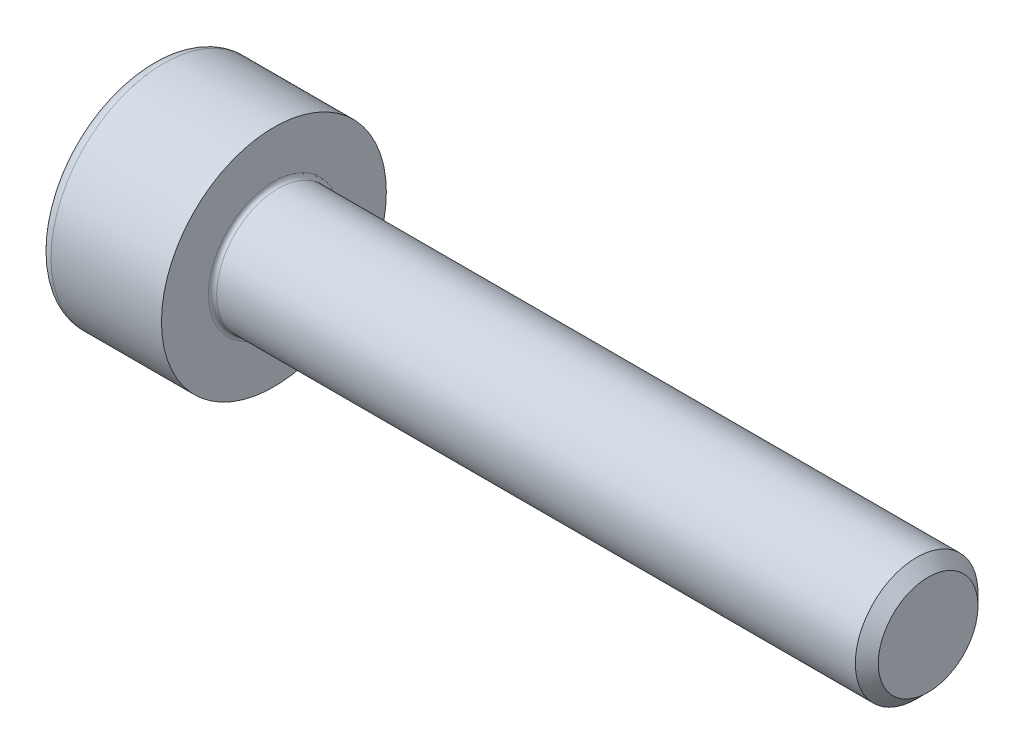
ISO-10303-21;
HEADER;
FILE_DESCRIPTION(('STEP AP214'),'2;1');
FILE_NAME('part.step','',(''),(''),'','','');
FILE_SCHEMA(('AUTOMOTIVE_DESIGN { 1 0 10303 214 1 1 1 1 }'));
ENDSEC;
DATA;
#1=APPLICATION_CONTEXT('core data for automotive mechanical design processes');
#2=APPLICATION_PROTOCOL_DEFINITION('international standard','automotive_design',2000,#1);
#3=PRODUCT_CONTEXT('',#1,'mechanical');
#4=PRODUCT('Part','Part','',(#3));
#5=PRODUCT_RELATED_PRODUCT_CATEGORY('part','',(#4));
#6=PRODUCT_DEFINITION_FORMATION('','',#4);
#7=PRODUCT_DEFINITION_CONTEXT('part definition',#1,'design');
#8=PRODUCT_DEFINITION('design','',#6,#7);
#9=PRODUCT_DEFINITION_SHAPE('','',#8);
#10=(LENGTH_UNIT() NAMED_UNIT(*) SI_UNIT(.MILLI.,.METRE.));
#11=(NAMED_UNIT(*) PLANE_ANGLE_UNIT() SI_UNIT($,.RADIAN.));
#12=(NAMED_UNIT(*) SI_UNIT($,.STERADIAN.) SOLID_ANGLE_UNIT());
#13=UNCERTAINTY_MEASURE_WITH_UNIT(LENGTH_MEASURE(1.E-05),#10,'distance_accuracy_value','');
#14=(GEOMETRIC_REPRESENTATION_CONTEXT(3) GLOBAL_UNCERTAINTY_ASSIGNED_CONTEXT((#13)) GLOBAL_UNIT_ASSIGNED_CONTEXT((#10,
#11,#12)) REPRESENTATION_CONTEXT('',''));
#15=CARTESIAN_POINT('',(0.,0.,0.));
#16=DIRECTION('',(0.,0.,1.));
#17=DIRECTION('',(1.,0.,0.));
#18=AXIS2_PLACEMENT_3D('',#15,#16,#17);
#19=CARTESIAN_POINT('',(0.,0.,0.));
#20=DIRECTION('',(-1.,0.,0.));
#21=DIRECTION('',(0.,0.,1.));
#22=AXIS2_PLACEMENT_3D('',#19,#20,#21);
#23=PLANE('',#22);
#24=DIRECTION('',(0.,-0.499999999999999,0.866025403784439));
#25=VECTOR('',#24,1.);
#26=CARTESIAN_POINT('',(0.,1.45492267835785,0.));
#27=LINE('',#26,#25);
#28=CARTESIAN_POINT('',(0.,1.45492267835785,0.));
#29=VERTEX_POINT('',#28);
#30=CARTESIAN_POINT('',(0.,0.727461339178922,1.26));
#31=VERTEX_POINT('',#30);
#32=EDGE_CURVE('E262',#29,#31,#27,.T.);
#33=ORIENTED_EDGE('',*,*,#32,.T.);
#34=DIRECTION('',(0.,1.,0.));
#35=VECTOR('',#34,1.);
#36=CARTESIAN_POINT('',(0.,-0.727461339178934,1.26));
#37=LINE('',#36,#35);
#38=CARTESIAN_POINT('',(0.,-0.727461339178934,1.26));
#39=VERTEX_POINT('',#38);
#40=EDGE_CURVE('E134',#39,#31,#37,.T.);
#41=ORIENTED_EDGE('',*,*,#40,.F.);
#42=DIRECTION('',(0.,-0.500000000000001,-0.866025403784438));
#43=VECTOR('',#42,1.);
#44=CARTESIAN_POINT('',(0.,-0.727461339178934,1.26));
#45=LINE('',#44,#43);
#46=CARTESIAN_POINT('',(0.,-1.45492267835786,0.));
#47=VERTEX_POINT('',#46);
#48=EDGE_CURVE('E265',#39,#47,#45,.T.);
#49=ORIENTED_EDGE('',*,*,#48,.T.);
#50=DIRECTION('',(0.,0.499999999999998,-0.86602540378444));
#51=VECTOR('',#50,1.);
#52=CARTESIAN_POINT('',(0.,-1.45492267835786,0.));
#53=LINE('',#52,#51);
#54=CARTESIAN_POINT('',(0.,-0.727461339178938,-1.26));
#55=VERTEX_POINT('',#54);
#56=EDGE_CURVE('E268',#47,#55,#53,.T.);
#57=ORIENTED_EDGE('',*,*,#56,.T.);
#58=DIRECTION('',(0.,-1.,0.));
#59=VECTOR('',#58,1.);
#60=CARTESIAN_POINT('',(0.,0.727461339178918,-1.26));
#61=LINE('',#60,#59);
#62=CARTESIAN_POINT('',(0.,0.727461339178918,-1.26));
#63=VERTEX_POINT('',#62);
#64=EDGE_CURVE('E271',#63,#55,#61,.T.);
#65=ORIENTED_EDGE('',*,*,#64,.F.);
#66=DIRECTION('',(0.,-0.500000000000001,-0.866025403784438));
#67=VECTOR('',#66,1.);
#68=CARTESIAN_POINT('',(0.,1.45492267835785,0.));
#69=LINE('',#68,#67);
#70=EDGE_CURVE('E129',#29,#63,#69,.T.);
#71=ORIENTED_EDGE('',*,*,#70,.F.);
#72=EDGE_LOOP('',(#33,#41,#49,#57,#65,#71));
#73=FACE_BOUND('',#72,.T.);
#74=CARTESIAN_POINT('',(0.,0.,0.));
#75=DIRECTION('',(-1.,0.,0.));
#76=DIRECTION('',(0.,0.,1.));
#77=AXIS2_PLACEMENT_3D('',#74,#75,#76);
#78=CIRCLE('',#77,2.45);
#79=CARTESIAN_POINT('',(0.,0.,2.45));
#80=VERTEX_POINT('',#79);
#81=EDGE_CURVE('E46',#80,#80,#78,.T.);
#82=ORIENTED_EDGE('',*,*,#81,.T.);
#83=EDGE_LOOP('',(#82));
#84=FACE_BOUND('',#83,.T.);
#85=ADVANCED_FACE('F38',(#73,#84),#23,.T.);
#86=CARTESIAN_POINT('',(-31.75,0.,0.));
#87=DIRECTION('',(-1.,0.,0.));
#88=DIRECTION('',(0.,0.,1.));
#89=AXIS2_PLACEMENT_3D('',#86,#87,#88);
#90=CYLINDRICAL_SURFACE('',#89,2.75);
#91=CARTESIAN_POINT('',(0.300000000000002,0.,0.));
#92=DIRECTION('',(-1.,0.,0.));
#93=DIRECTION('',(0.,0.,1.));
#94=AXIS2_PLACEMENT_3D('',#91,#92,#93);
#95=CIRCLE('',#94,2.75);
#96=CARTESIAN_POINT('',(0.300000000000002,0.,2.75));
#97=VERTEX_POINT('',#96);
#98=EDGE_CURVE('E11',#97,#97,#95,.F.);
#99=ORIENTED_EDGE('',*,*,#98,.T.);
#100=EDGE_LOOP('',(#99));
#101=FACE_BOUND('',#100,.T.);
#102=CARTESIAN_POINT('',(3.,0.,0.));
#103=DIRECTION('',(-1.,0.,0.));
#104=DIRECTION('',(0.,0.,1.));
#105=AXIS2_PLACEMENT_3D('',#102,#103,#104);
#106=CIRCLE('',#105,2.75);
#107=CARTESIAN_POINT('',(3.,0.,2.75));
#108=VERTEX_POINT('',#107);
#109=EDGE_CURVE('E152',#108,#108,#106,.T.);
#110=ORIENTED_EDGE('',*,*,#109,.T.);
#111=EDGE_LOOP('',(#110));
#112=FACE_BOUND('',#111,.T.);
#113=ADVANCED_FACE('F176',(#101,#112),#90,.T.);
#114=CARTESIAN_POINT('',(3.,2.75,0.));
#115=DIRECTION('',(1.,0.,0.));
#116=DIRECTION('',(0.,0.,-1.));
#117=AXIS2_PLACEMENT_3D('',#114,#115,#116);
#118=PLANE('',#117);
#119=CARTESIAN_POINT('',(3.,0.,0.));
#120=DIRECTION('',(1.,0.,0.));
#121=DIRECTION('',(0.,0.,-1.));
#122=AXIS2_PLACEMENT_3D('',#119,#120,#121);
#123=CIRCLE('',#122,1.59999999999996);
#124=CARTESIAN_POINT('',(3.,0.,-1.59999999999996));
#125=VERTEX_POINT('',#124);
#126=EDGE_CURVE('E155',#125,#125,#123,.F.);
#127=ORIENTED_EDGE('',*,*,#126,.T.);
#128=EDGE_LOOP('',(#127));
#129=FACE_BOUND('',#128,.T.);
#130=ORIENTED_EDGE('',*,*,#109,.F.);
#131=EDGE_LOOP('',(#130));
#132=FACE_BOUND('',#131,.T.);
#133=ADVANCED_FACE('F182',(#129,#132),#118,.T.);
#134=CARTESIAN_POINT('',(-31.75,0.,0.));
#135=DIRECTION('',(-1.,0.,0.));
#136=DIRECTION('',(0.,0.,1.));
#137=AXIS2_PLACEMENT_3D('',#134,#135,#136);
#138=CYLINDRICAL_SURFACE('',#137,1.49999999999996);
#139=CARTESIAN_POINT('',(3.1,0.,0.));
#140=DIRECTION('',(1.,0.,0.));
#141=DIRECTION('',(0.,0.,-1.));
#142=AXIS2_PLACEMENT_3D('',#139,#140,#141);
#143=CIRCLE('',#142,1.49999999999996);
#144=CARTESIAN_POINT('',(3.1,0.,-1.49999999999996));
#145=VERTEX_POINT('',#144);
#146=EDGE_CURVE('E158',#145,#145,#143,.T.);
#147=ORIENTED_EDGE('',*,*,#146,.T.);
#148=EDGE_LOOP('',(#147));
#149=FACE_BOUND('',#148,.T.);
#150=CARTESIAN_POINT('',(18.7194999999999,0.,0.));
#151=DIRECTION('',(-1.,0.,0.));
#152=DIRECTION('',(0.,0.,1.));
#153=AXIS2_PLACEMENT_3D('',#150,#151,#152);
#154=CIRCLE('',#153,1.49999999999991);
#155=CARTESIAN_POINT('',(18.7194999999999,0.,1.49999999999991));
#156=VERTEX_POINT('',#155);
#157=EDGE_CURVE('E149',#156,#156,#154,.T.);
#158=ORIENTED_EDGE('',*,*,#157,.T.);
#159=EDGE_LOOP('',(#158));
#160=FACE_BOUND('',#159,.T.);
#161=ADVANCED_FACE('F188',(#149,#160),#138,.T.);
#162=CARTESIAN_POINT('',(19.,0.,0.));
#163=DIRECTION('',(-1.,0.,0.));
#164=DIRECTION('',(0.,0.,1.));
#165=AXIS2_PLACEMENT_3D('',#162,#163,#164);
#166=CONICAL_SURFACE('',#165,1.2195,0.785398163397138);
#167=ORIENTED_EDGE('',*,*,#157,.F.);
#168=EDGE_LOOP('',(#167));
#169=FACE_BOUND('',#168,.T.);
#170=CARTESIAN_POINT('',(19.,0.,0.));
#171=DIRECTION('',(-1.,0.,0.));
#172=DIRECTION('',(0.,0.,1.));
#173=AXIS2_PLACEMENT_3D('',#170,#171,#172);
#174=CIRCLE('',#173,1.2195);
#175=CARTESIAN_POINT('',(19.,0.,1.2195));
#176=VERTEX_POINT('',#175);
#177=EDGE_CURVE('E145',#176,#176,#174,.T.);
#178=ORIENTED_EDGE('',*,*,#177,.T.);
#179=EDGE_LOOP('',(#178));
#180=FACE_BOUND('',#179,.T.);
#181=ADVANCED_FACE('F192',(#169,#180),#166,.T.);
#182=CARTESIAN_POINT('',(19.,1.2195,0.));
#183=DIRECTION('',(1.,0.,0.));
#184=DIRECTION('',(0.,0.,-1.));
#185=AXIS2_PLACEMENT_3D('',#182,#183,#184);
#186=PLANE('',#185);
#187=ORIENTED_EDGE('',*,*,#177,.F.);
#188=EDGE_LOOP('',(#187));
#189=FACE_BOUND('',#188,.T.);
#190=ADVANCED_FACE('F172',(#189),#186,.T.);
#191=CARTESIAN_POINT('',(3.1,0.,0.));
#192=DIRECTION('',(1.,0.,0.));
#193=DIRECTION('',(0.,0.,-1.));
#194=AXIS2_PLACEMENT_3D('',#191,#192,#193);
#195=TOROIDAL_SURFACE('',#194,1.59999999999996,0.1);
#196=ORIENTED_EDGE('',*,*,#146,.F.);
#197=EDGE_LOOP('',(#196));
#198=FACE_BOUND('',#197,.T.);
#199=ORIENTED_EDGE('',*,*,#126,.F.);
#200=EDGE_LOOP('',(#199));
#201=FACE_BOUND('',#200,.T.);
#202=ADVANCED_FACE('F165',(#198,#201),#195,.F.);
#203=CARTESIAN_POINT('',(0.300000000000002,0.,0.));
#204=DIRECTION('',(-1.,0.,0.));
#205=DIRECTION('',(0.,0.,1.));
#206=AXIS2_PLACEMENT_3D('',#203,#204,#205);
#207=TOROIDAL_SURFACE('',#206,2.45,0.3);
#208=ORIENTED_EDGE('',*,*,#98,.F.);
#209=EDGE_LOOP('',(#208));
#210=FACE_BOUND('',#209,.T.);
#211=ORIENTED_EDGE('',*,*,#81,.F.);
#212=EDGE_LOOP('',(#211));
#213=FACE_BOUND('',#212,.T.);
#214=ADVANCED_FACE('F40',(#210,#213),#207,.T.);
#215=CARTESIAN_POINT('',(1.3,1.45492267835785,0.));
#216=DIRECTION('',(0.,-0.866025403784439,-0.499999999999999));
#217=DIRECTION('',(0.,0.499999999999999,-0.866025403784439));
#218=AXIS2_PLACEMENT_3D('',#215,#216,#217);
#219=PLANE('',#218);
#220=ORIENTED_EDGE('',*,*,#32,.F.);
#221=DIRECTION('',(-1.,0.,0.));
#222=VECTOR('',#221,1.);
#223=CARTESIAN_POINT('',(1.3,1.45492267835785,0.));
#224=LINE('',#223,#222);
#225=CARTESIAN_POINT('',(1.3,1.45492267835785,0.));
#226=VERTEX_POINT('',#225);
#227=EDGE_CURVE('E252',#226,#29,#224,.T.);
#228=ORIENTED_EDGE('',*,*,#227,.F.);
#229=DIRECTION('',(0.,-0.499999999999999,0.866025403784439));
#230=VECTOR('',#229,1.);
#231=CARTESIAN_POINT('',(1.3,1.45492267835785,0.));
#232=LINE('',#231,#230);
#233=CARTESIAN_POINT('',(1.3,1.09119200876839,0.629999999999996));
#234=VERTEX_POINT('',#233);
#235=EDGE_CURVE('E121',#226,#234,#232,.T.);
#236=ORIENTED_EDGE('',*,*,#235,.T.);
#237=CARTESIAN_POINT('',(1.3,0.727461339178922,1.26));
#238=VERTEX_POINT('',#237);
#239=EDGE_CURVE('E112',#234,#238,#232,.T.);
#240=ORIENTED_EDGE('',*,*,#239,.T.);
#241=DIRECTION('',(-1.,0.,0.));
#242=VECTOR('',#241,1.);
#243=CARTESIAN_POINT('',(1.3,0.727461339178922,1.26));
#244=LINE('',#243,#242);
#245=EDGE_CURVE('E126',#238,#31,#244,.T.);
#246=ORIENTED_EDGE('',*,*,#245,.T.);
#247=EDGE_LOOP('',(#220,#228,#236,#240,#246));
#248=FACE_BOUND('',#247,.T.);
#249=ADVANCED_FACE('F125',(#248),#219,.T.);
#250=CARTESIAN_POINT('',(1.3,-0.727461339178934,1.26));
#251=DIRECTION('',(0.,0.,1.));
#252=DIRECTION('',(0.,-1.,0.));
#253=AXIS2_PLACEMENT_3D('',#250,#251,#252);
#254=PLANE('',#253);
#255=ORIENTED_EDGE('',*,*,#40,.T.);
#256=ORIENTED_EDGE('',*,*,#245,.F.);
#257=DIRECTION('',(0.,1.,0.));
#258=VECTOR('',#257,1.);
#259=CARTESIAN_POINT('',(1.3,-0.727461339178934,1.26));
#260=LINE('',#259,#258);
#261=CARTESIAN_POINT('',(1.3,0.,1.26));
#262=VERTEX_POINT('',#261);
#263=EDGE_CURVE('E109',#262,#238,#260,.T.);
#264=ORIENTED_EDGE('',*,*,#263,.F.);
#265=CARTESIAN_POINT('',(1.3,-0.727461339178934,1.26));
#266=VERTEX_POINT('',#265);
#267=EDGE_CURVE('E120',#266,#262,#260,.T.);
#268=ORIENTED_EDGE('',*,*,#267,.F.);
#269=DIRECTION('',(-1.,0.,0.));
#270=VECTOR('',#269,1.);
#271=CARTESIAN_POINT('',(1.3,-0.727461339178934,1.26));
#272=LINE('',#271,#270);
#273=EDGE_CURVE('E136',#266,#39,#272,.T.);
#274=ORIENTED_EDGE('',*,*,#273,.T.);
#275=EDGE_LOOP('',(#255,#256,#264,#268,#274));
#276=FACE_BOUND('',#275,.T.);
#277=ADVANCED_FACE('F131',(#276),#254,.F.);
#278=CARTESIAN_POINT('',(1.3,-0.727461339178934,1.26));
#279=DIRECTION('',(0.,0.866025403784438,-0.500000000000001));
#280=DIRECTION('',(0.,0.500000000000001,0.866025403784438));
#281=AXIS2_PLACEMENT_3D('',#278,#279,#280);
#282=PLANE('',#281);
#283=ORIENTED_EDGE('',*,*,#48,.F.);
#284=ORIENTED_EDGE('',*,*,#273,.F.);
#285=DIRECTION('',(0.,-0.500000000000001,-0.866025403784438));
#286=VECTOR('',#285,1.);
#287=CARTESIAN_POINT('',(1.3,-0.727461339178934,1.26));
#288=LINE('',#287,#286);
#289=CARTESIAN_POINT('',(1.3,-1.0911920087684,0.630000000000005));
#290=VERTEX_POINT('',#289);
#291=EDGE_CURVE('E291',#266,#290,#288,.T.);
#292=ORIENTED_EDGE('',*,*,#291,.T.);
#293=CARTESIAN_POINT('',(1.3,-1.45492267835786,0.));
#294=VERTEX_POINT('',#293);
#295=EDGE_CURVE('E280',#290,#294,#288,.T.);
#296=ORIENTED_EDGE('',*,*,#295,.T.);
#297=DIRECTION('',(-1.,0.,0.));
#298=VECTOR('',#297,1.);
#299=CARTESIAN_POINT('',(1.3,-1.45492267835786,0.));
#300=LINE('',#299,#298);
#301=EDGE_CURVE('E141',#294,#47,#300,.T.);
#302=ORIENTED_EDGE('',*,*,#301,.T.);
#303=EDGE_LOOP('',(#283,#284,#292,#296,#302));
#304=FACE_BOUND('',#303,.T.);
#305=ADVANCED_FACE('F206',(#304),#282,.T.);
#306=CARTESIAN_POINT('',(1.3,-1.45492267835786,0.));
#307=DIRECTION('',(0.,0.86602540378444,0.499999999999998));
#308=DIRECTION('',(0.,-0.499999999999998,0.86602540378444));
#309=AXIS2_PLACEMENT_3D('',#306,#307,#308);
#310=PLANE('',#309);
#311=ORIENTED_EDGE('',*,*,#56,.F.);
#312=ORIENTED_EDGE('',*,*,#301,.F.);
#313=DIRECTION('',(0.,0.499999999999998,-0.86602540378444));
#314=VECTOR('',#313,1.);
#315=CARTESIAN_POINT('',(1.3,-1.45492267835786,0.));
#316=LINE('',#315,#314);
#317=CARTESIAN_POINT('',(1.3,-1.0911920087684,-0.63));
#318=VERTEX_POINT('',#317);
#319=EDGE_CURVE('E258',#294,#318,#316,.T.);
#320=ORIENTED_EDGE('',*,*,#319,.T.);
#321=CARTESIAN_POINT('',(1.3,-0.727461339178938,-1.26));
#322=VERTEX_POINT('',#321);
#323=EDGE_CURVE('E290',#318,#322,#316,.T.);
#324=ORIENTED_EDGE('',*,*,#323,.T.);
#325=DIRECTION('',(-1.,0.,0.));
#326=VECTOR('',#325,1.);
#327=CARTESIAN_POINT('',(1.3,-0.727461339178938,-1.26));
#328=LINE('',#327,#326);
#329=EDGE_CURVE('E251',#322,#55,#328,.T.);
#330=ORIENTED_EDGE('',*,*,#329,.T.);
#331=EDGE_LOOP('',(#311,#312,#320,#324,#330));
#332=FACE_BOUND('',#331,.T.);
#333=ADVANCED_FACE('F209',(#332),#310,.T.);
#334=CARTESIAN_POINT('',(1.3,0.727461339178918,-1.26));
#335=DIRECTION('',(0.,0.,-1.));
#336=DIRECTION('',(0.,1.,0.));
#337=AXIS2_PLACEMENT_3D('',#334,#335,#336);
#338=PLANE('',#337);
#339=ORIENTED_EDGE('',*,*,#64,.T.);
#340=ORIENTED_EDGE('',*,*,#329,.F.);
#341=DIRECTION('',(0.,-1.,0.));
#342=VECTOR('',#341,1.);
#343=CARTESIAN_POINT('',(1.3,0.727461339178918,-1.26));
#344=LINE('',#343,#342);
#345=CARTESIAN_POINT('',(1.3,0.,-1.26));
#346=VERTEX_POINT('',#345);
#347=EDGE_CURVE('E255',#346,#322,#344,.T.);
#348=ORIENTED_EDGE('',*,*,#347,.F.);
#349=CARTESIAN_POINT('',(1.3,0.727461339178918,-1.26));
#350=VERTEX_POINT('',#349);
#351=EDGE_CURVE('E53',#350,#346,#344,.T.);
#352=ORIENTED_EDGE('',*,*,#351,.F.);
#353=DIRECTION('',(-1.,0.,0.));
#354=VECTOR('',#353,1.);
#355=CARTESIAN_POINT('',(1.3,0.727461339178918,-1.26));
#356=LINE('',#355,#354);
#357=EDGE_CURVE('E248',#350,#63,#356,.T.);
#358=ORIENTED_EDGE('',*,*,#357,.T.);
#359=EDGE_LOOP('',(#339,#340,#348,#352,#358));
#360=FACE_BOUND('',#359,.T.);
#361=ADVANCED_FACE('F213',(#360),#338,.F.);
#362=CARTESIAN_POINT('',(1.3,1.45492267835785,0.));
#363=DIRECTION('',(0.,0.866025403784438,-0.500000000000001));
#364=DIRECTION('',(0.,0.500000000000001,0.866025403784438));
#365=AXIS2_PLACEMENT_3D('',#362,#363,#364);
#366=PLANE('',#365);
#367=ORIENTED_EDGE('',*,*,#70,.T.);
#368=ORIENTED_EDGE('',*,*,#357,.F.);
#369=DIRECTION('',(0.,-0.500000000000001,-0.866025403784438));
#370=VECTOR('',#369,1.);
#371=CARTESIAN_POINT('',(1.3,1.45492267835785,0.));
#372=LINE('',#371,#370);
#373=CARTESIAN_POINT('',(1.3,1.09119200876838,-0.629999999999997));
#374=VERTEX_POINT('',#373);
#375=EDGE_CURVE('E238',#374,#350,#372,.T.);
#376=ORIENTED_EDGE('',*,*,#375,.F.);
#377=EDGE_CURVE('E244',#226,#374,#372,.T.);
#378=ORIENTED_EDGE('',*,*,#377,.F.);
#379=ORIENTED_EDGE('',*,*,#227,.T.);
#380=EDGE_LOOP('',(#367,#368,#376,#378,#379));
#381=FACE_BOUND('',#380,.T.);
#382=ADVANCED_FACE('F217',(#381),#366,.F.);
#383=CARTESIAN_POINT('',(1.3,2.18238401753677,-1.26));
#384=DIRECTION('',(1.,0.,0.));
#385=DIRECTION('',(0.,0.,-1.));
#386=AXIS2_PLACEMENT_3D('',#383,#384,#385);
#387=PLANE('',#386);
#388=ORIENTED_EDGE('',*,*,#347,.T.);
#389=ORIENTED_EDGE('',*,*,#323,.F.);
#390=CARTESIAN_POINT('',(1.3,0.,0.));
#391=DIRECTION('',(-1.,0.,0.));
#392=DIRECTION('',(0.,0.,1.));
#393=AXIS2_PLACEMENT_3D('',#390,#391,#392);
#394=CIRCLE('',#393,1.26);
#395=EDGE_CURVE('E286',#346,#318,#394,.T.);
#396=ORIENTED_EDGE('',*,*,#395,.F.);
#397=EDGE_LOOP('',(#388,#389,#396));
#398=FACE_BOUND('',#397,.T.);
#399=ADVANCED_FACE('F221',(#398),#387,.F.);
#400=ORIENTED_EDGE('',*,*,#319,.F.);
#401=ORIENTED_EDGE('',*,*,#295,.F.);
#402=EDGE_CURVE('E139',#318,#290,#394,.T.);
#403=ORIENTED_EDGE('',*,*,#402,.F.);
#404=EDGE_LOOP('',(#400,#401,#403));
#405=FACE_BOUND('',#404,.T.);
#406=ADVANCED_FACE('F224',(#405),#387,.F.);
#407=ORIENTED_EDGE('',*,*,#291,.F.);
#408=ORIENTED_EDGE('',*,*,#267,.T.);
#409=EDGE_CURVE('E135',#290,#262,#394,.T.);
#410=ORIENTED_EDGE('',*,*,#409,.F.);
#411=EDGE_LOOP('',(#407,#408,#410));
#412=FACE_BOUND('',#411,.T.);
#413=ADVANCED_FACE('F229',(#412),#387,.F.);
#414=ORIENTED_EDGE('',*,*,#263,.T.);
#415=ORIENTED_EDGE('',*,*,#239,.F.);
#416=EDGE_CURVE('E115',#262,#234,#394,.T.);
#417=ORIENTED_EDGE('',*,*,#416,.F.);
#418=EDGE_LOOP('',(#414,#415,#417));
#419=FACE_BOUND('',#418,.T.);
#420=ADVANCED_FACE('F111',(#419),#387,.F.);
#421=ORIENTED_EDGE('',*,*,#235,.F.);
#422=ORIENTED_EDGE('',*,*,#377,.T.);
#423=EDGE_CURVE('E146',#234,#374,#394,.T.);
#424=ORIENTED_EDGE('',*,*,#423,.F.);
#425=EDGE_LOOP('',(#421,#422,#424));
#426=FACE_BOUND('',#425,.T.);
#427=ADVANCED_FACE('F232',(#426),#387,.F.);
#428=ORIENTED_EDGE('',*,*,#375,.T.);
#429=ORIENTED_EDGE('',*,*,#351,.T.);
#430=EDGE_CURVE('E241',#374,#346,#394,.T.);
#431=ORIENTED_EDGE('',*,*,#430,.F.);
#432=EDGE_LOOP('',(#428,#429,#431));
#433=FACE_BOUND('',#432,.T.);
#434=ADVANCED_FACE('F202',(#433),#387,.F.);
#435=CARTESIAN_POINT('',(1.3,0.,0.));
#436=DIRECTION('',(-1.,0.,0.));
#437=DIRECTION('',(0.,0.,1.));
#438=AXIS2_PLACEMENT_3D('',#435,#436,#437);
#439=CONICAL_SURFACE('',#438,1.26,1.04719755119659);
#440=CARTESIAN_POINT('',(2.02746133917894,0.,0.));
#441=VERTEX_POINT('',#440);
#442=VERTEX_LOOP('',#441);
#443=FACE_BOUND('',#442,.T.);
#444=ORIENTED_EDGE('',*,*,#416,.T.);
#445=ORIENTED_EDGE('',*,*,#423,.T.);
#446=ORIENTED_EDGE('',*,*,#430,.T.);
#447=ORIENTED_EDGE('',*,*,#395,.T.);
#448=ORIENTED_EDGE('',*,*,#402,.T.);
#449=ORIENTED_EDGE('',*,*,#409,.T.);
#450=EDGE_LOOP('',(#444,#445,#446,#447,#448,#449));
#451=FACE_BOUND('',#450,.T.);
#452=ADVANCED_FACE('F200',(#443,#451),#439,.F.);
#453=CLOSED_SHELL('',(#85,#113,#133,#161,#181,#190,#202,#214,#249,#277,#305,#333,#361,#382,#399,
#406,#413,#420,#427,#434,#452));
#454=MANIFOLD_SOLID_BREP('B2',#453);
#455=ADVANCED_BREP_SHAPE_REPRESENTATION('',(#18,#454),#14);
#456=SHAPE_DEFINITION_REPRESENTATION(#9,#455);
ENDSEC;
END-ISO-10303-21;
